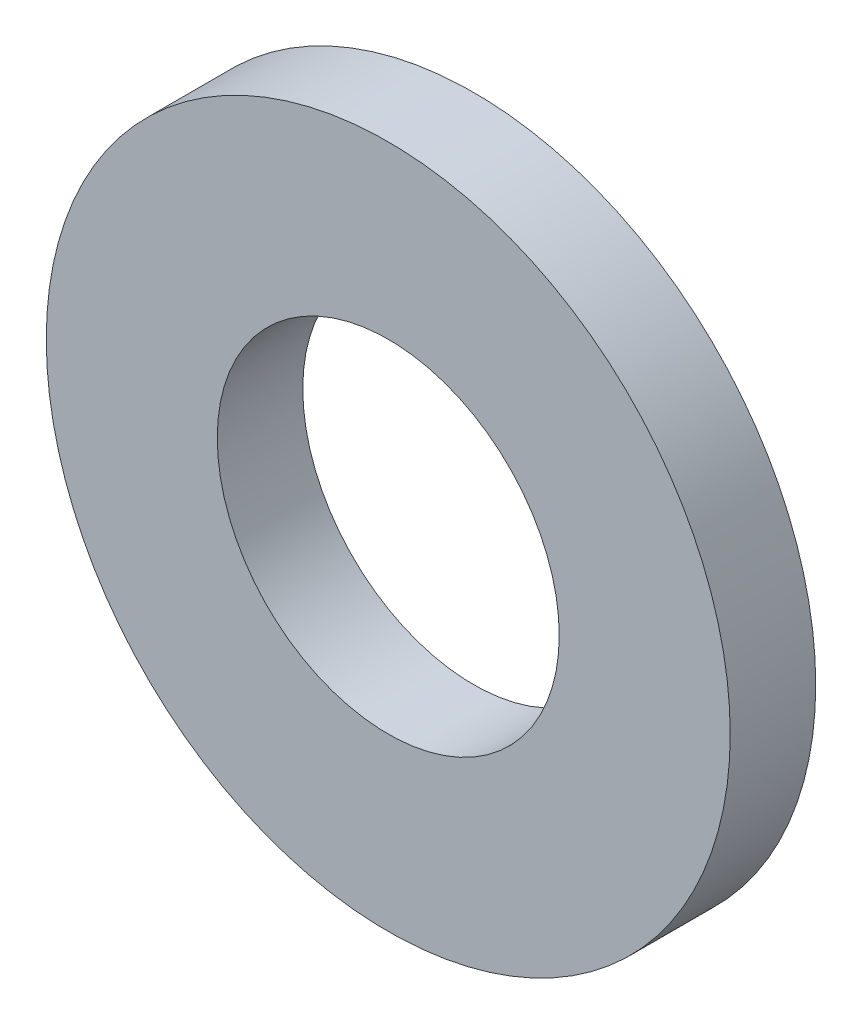
ISO-10303-21;
HEADER;
FILE_DESCRIPTION(('STEP AP214'),'2;1');
FILE_NAME('part.step','',(''),(''),'','','');
FILE_SCHEMA(('AUTOMOTIVE_DESIGN { 1 0 10303 214 1 1 1 1 }'));
ENDSEC;
DATA;
#1=APPLICATION_CONTEXT('core data for automotive mechanical design processes');
#2=APPLICATION_PROTOCOL_DEFINITION('international standard','automotive_design',2000,#1);
#3=PRODUCT_CONTEXT('',#1,'mechanical');
#4=PRODUCT('Part','Part','',(#3));
#5=PRODUCT_RELATED_PRODUCT_CATEGORY('part','',(#4));
#6=PRODUCT_DEFINITION_FORMATION('','',#4);
#7=PRODUCT_DEFINITION_CONTEXT('part definition',#1,'design');
#8=PRODUCT_DEFINITION('design','',#6,#7);
#9=PRODUCT_DEFINITION_SHAPE('','',#8);
#10=(LENGTH_UNIT() NAMED_UNIT(*) SI_UNIT(.MILLI.,.METRE.));
#11=(NAMED_UNIT(*) PLANE_ANGLE_UNIT() SI_UNIT($,.RADIAN.));
#12=(NAMED_UNIT(*) SI_UNIT($,.STERADIAN.) SOLID_ANGLE_UNIT());
#13=UNCERTAINTY_MEASURE_WITH_UNIT(LENGTH_MEASURE(1.E-05),#10,'distance_accuracy_value','');
#14=(GEOMETRIC_REPRESENTATION_CONTEXT(3) GLOBAL_UNCERTAINTY_ASSIGNED_CONTEXT((#13)) GLOBAL_UNIT_ASSIGNED_CONTEXT((#10,
#11,#12)) REPRESENTATION_CONTEXT('',''));
#15=CARTESIAN_POINT('',(0.,0.,0.));
#16=DIRECTION('',(0.,0.,1.));
#17=DIRECTION('',(1.,0.,0.));
#18=AXIS2_PLACEMENT_3D('',#15,#16,#17);
#19=CARTESIAN_POINT('',(0.,0.,1.5875));
#20=DIRECTION('',(0.,0.,1.));
#21=DIRECTION('',(1.,0.,0.));
#22=AXIS2_PLACEMENT_3D('',#19,#20,#21);
#23=PLANE('',#22);
#24=CARTESIAN_POINT('',(0.,0.,1.5875));
#25=DIRECTION('',(0.,0.,1.));
#26=DIRECTION('',(1.,0.,0.));
#27=AXIS2_PLACEMENT_3D('',#24,#25,#26);
#28=CIRCLE('',#27,6.35);
#29=CARTESIAN_POINT('',(6.35,0.,1.5875));
#30=VERTEX_POINT('',#29);
#31=EDGE_CURVE('E10',#30,#30,#28,.T.);
#32=ORIENTED_EDGE('',*,*,#31,.T.);
#33=EDGE_LOOP('',(#32));
#34=FACE_BOUND('',#33,.T.);
#35=CARTESIAN_POINT('',(0.,0.,1.5875));
#36=DIRECTION('',(0.,0.,1.));
#37=DIRECTION('',(1.,0.,0.));
#38=AXIS2_PLACEMENT_3D('',#35,#36,#37);
#39=CIRCLE('',#38,3.175);
#40=CARTESIAN_POINT('',(3.175,0.,1.5875));
#41=VERTEX_POINT('',#40);
#42=EDGE_CURVE('E50',#41,#41,#39,.T.);
#43=ORIENTED_EDGE('',*,*,#42,.F.);
#44=EDGE_LOOP('',(#43));
#45=FACE_BOUND('',#44,.T.);
#46=ADVANCED_FACE('F37',(#34,#45),#23,.T.);
#47=CARTESIAN_POINT('',(0.,0.,0.));
#48=DIRECTION('',(0.,0.,1.));
#49=DIRECTION('',(1.,0.,0.));
#50=AXIS2_PLACEMENT_3D('',#47,#48,#49);
#51=PLANE('',#50);
#52=CARTESIAN_POINT('',(0.,0.,0.));
#53=DIRECTION('',(0.,0.,1.));
#54=DIRECTION('',(1.,0.,0.));
#55=AXIS2_PLACEMENT_3D('',#52,#53,#54);
#56=CIRCLE('',#55,6.35);
#57=CARTESIAN_POINT('',(6.35,0.,0.));
#58=VERTEX_POINT('',#57);
#59=EDGE_CURVE('E41',#58,#58,#56,.T.);
#60=ORIENTED_EDGE('',*,*,#59,.F.);
#61=EDGE_LOOP('',(#60));
#62=FACE_BOUND('',#61,.T.);
#63=CARTESIAN_POINT('',(0.,0.,0.));
#64=DIRECTION('',(0.,0.,1.));
#65=DIRECTION('',(1.,0.,0.));
#66=AXIS2_PLACEMENT_3D('',#63,#64,#65);
#67=CIRCLE('',#66,3.175);
#68=CARTESIAN_POINT('',(3.175,0.,0.));
#69=VERTEX_POINT('',#68);
#70=EDGE_CURVE('E52',#69,#69,#67,.T.);
#71=ORIENTED_EDGE('',*,*,#70,.T.);
#72=EDGE_LOOP('',(#71));
#73=FACE_BOUND('',#72,.T.);
#74=ADVANCED_FACE('F64',(#62,#73),#51,.F.);
#75=CARTESIAN_POINT('',(0.,0.,1.5875));
#76=DIRECTION('',(0.,0.,-1.));
#77=DIRECTION('',(-1.,0.,0.));
#78=AXIS2_PLACEMENT_3D('',#75,#76,#77);
#79=CYLINDRICAL_SURFACE('',#78,6.35);
#80=ORIENTED_EDGE('',*,*,#31,.F.);
#81=EDGE_LOOP('',(#80));
#82=FACE_BOUND('',#81,.T.);
#83=ORIENTED_EDGE('',*,*,#59,.T.);
#84=EDGE_LOOP('',(#83));
#85=FACE_BOUND('',#84,.T.);
#86=ADVANCED_FACE('F39',(#82,#85),#79,.T.);
#87=CARTESIAN_POINT('',(0.,0.,1.5875));
#88=DIRECTION('',(0.,0.,-1.));
#89=DIRECTION('',(-1.,0.,0.));
#90=AXIS2_PLACEMENT_3D('',#87,#88,#89);
#91=CYLINDRICAL_SURFACE('',#90,3.175);
#92=ORIENTED_EDGE('',*,*,#42,.T.);
#93=EDGE_LOOP('',(#92));
#94=FACE_BOUND('',#93,.T.);
#95=ORIENTED_EDGE('',*,*,#70,.F.);
#96=EDGE_LOOP('',(#95));
#97=FACE_BOUND('',#96,.T.);
#98=ADVANCED_FACE('F60',(#94,#97),#91,.F.);
#99=CLOSED_SHELL('',(#46,#74,#86,#98));
#100=MANIFOLD_SOLID_BREP('B2',#99);
#101=ADVANCED_BREP_SHAPE_REPRESENTATION('',(#18,#100),#14);
#102=SHAPE_DEFINITION_REPRESENTATION(#9,#101);
ENDSEC;
END-ISO-10303-21;
